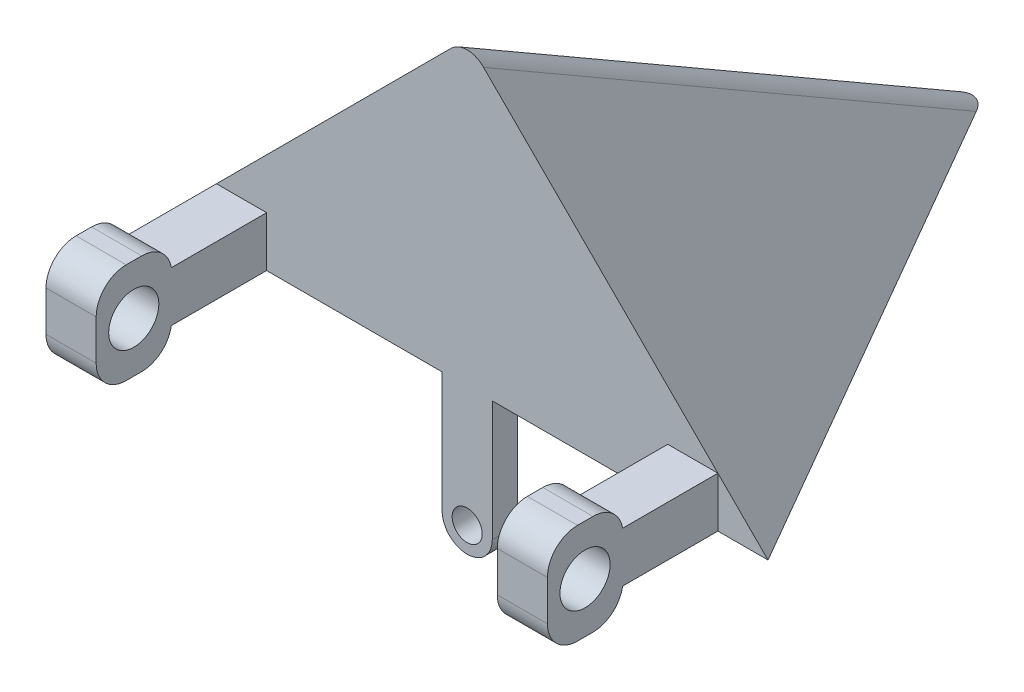
ISO-10303-21;
HEADER;
FILE_DESCRIPTION(('STEP AP214'),'2;1');
FILE_NAME('part.step','',(''),(''),'','','');
FILE_SCHEMA(('AUTOMOTIVE_DESIGN { 1 0 10303 214 1 1 1 1 }'));
ENDSEC;
DATA;
#1=APPLICATION_CONTEXT('core data for automotive mechanical design processes');
#2=APPLICATION_PROTOCOL_DEFINITION('international standard','automotive_design',2000,#1);
#3=PRODUCT_CONTEXT('',#1,'mechanical');
#4=PRODUCT('Part','Part','',(#3));
#5=PRODUCT_RELATED_PRODUCT_CATEGORY('part','',(#4));
#6=PRODUCT_DEFINITION_FORMATION('','',#4);
#7=PRODUCT_DEFINITION_CONTEXT('part definition',#1,'design');
#8=PRODUCT_DEFINITION('design','',#6,#7);
#9=PRODUCT_DEFINITION_SHAPE('','',#8);
#10=(LENGTH_UNIT() NAMED_UNIT(*) SI_UNIT(.MILLI.,.METRE.));
#11=(NAMED_UNIT(*) PLANE_ANGLE_UNIT() SI_UNIT($,.RADIAN.));
#12=(NAMED_UNIT(*) SI_UNIT($,.STERADIAN.) SOLID_ANGLE_UNIT());
#13=UNCERTAINTY_MEASURE_WITH_UNIT(LENGTH_MEASURE(1.E-05),#10,'distance_accuracy_value','');
#14=(GEOMETRIC_REPRESENTATION_CONTEXT(3) GLOBAL_UNCERTAINTY_ASSIGNED_CONTEXT((#13)) GLOBAL_UNIT_ASSIGNED_CONTEXT((#10,
#11,#12)) REPRESENTATION_CONTEXT('',''));
#15=CARTESIAN_POINT('',(0.,0.,0.));
#16=DIRECTION('',(0.,0.,1.));
#17=DIRECTION('',(1.,0.,0.));
#18=AXIS2_PLACEMENT_3D('',#15,#16,#17);
#19=CARTESIAN_POINT('',(0.,0.,0.));
#20=DIRECTION('',(0.,0.,-1.));
#21=DIRECTION('',(-1.,0.,0.));
#22=AXIS2_PLACEMENT_3D('',#19,#20,#21);
#23=PLANE('',#22);
#24=CARTESIAN_POINT('',(-30.,-12.,0.));
#25=DIRECTION('',(0.,0.,1.));
#26=DIRECTION('',(1.,0.,0.));
#27=AXIS2_PLACEMENT_3D('',#24,#25,#26);
#28=CIRCLE('',#27,1.5);
#29=CARTESIAN_POINT('',(-28.5,-12.,0.));
#30=VERTEX_POINT('',#29);
#31=EDGE_CURVE('E416',#30,#30,#28,.T.);
#32=ORIENTED_EDGE('',*,*,#31,.F.);
#33=EDGE_LOOP('',(#32));
#34=FACE_BOUND('',#33,.T.);
#35=DIRECTION('',(0.,1.,0.));
#36=VECTOR('',#35,1.);
#37=CARTESIAN_POINT('',(-32.5,-14.5,0.));
#38=LINE('',#37,#36);
#39=CARTESIAN_POINT('',(-32.5,-12.,0.));
#40=VERTEX_POINT('',#39);
#41=CARTESIAN_POINT('',(-32.5,0.,0.));
#42=VERTEX_POINT('',#41);
#43=EDGE_CURVE('E589',#40,#42,#38,.T.);
#44=ORIENTED_EDGE('',*,*,#43,.F.);
#45=CARTESIAN_POINT('',(-30.,-12.,0.));
#46=DIRECTION('',(0.,0.,-1.));
#47=DIRECTION('',(-1.,0.,0.));
#48=AXIS2_PLACEMENT_3D('',#45,#46,#47);
#49=CIRCLE('',#48,2.5);
#50=CARTESIAN_POINT('',(-30.,-14.5,0.));
#51=VERTEX_POINT('',#50);
#52=EDGE_CURVE('E431',#40,#51,#49,.F.);
#53=ORIENTED_EDGE('',*,*,#52,.T.);
#54=CARTESIAN_POINT('',(-30.,-12.,0.));
#55=DIRECTION('',(0.,0.,-1.));
#56=DIRECTION('',(-1.,0.,0.));
#57=AXIS2_PLACEMENT_3D('',#54,#55,#56);
#58=CIRCLE('',#57,2.5);
#59=CARTESIAN_POINT('',(-27.5,-12.,0.));
#60=VERTEX_POINT('',#59);
#61=EDGE_CURVE('E428',#51,#60,#58,.F.);
#62=ORIENTED_EDGE('',*,*,#61,.T.);
#63=DIRECTION('',(0.,1.,0.));
#64=VECTOR('',#63,1.);
#65=CARTESIAN_POINT('',(-27.5,-14.5,0.));
#66=LINE('',#65,#64);
#67=CARTESIAN_POINT('',(-27.5,0.,0.));
#68=VERTEX_POINT('',#67);
#69=EDGE_CURVE('E592',#60,#68,#66,.T.);
#70=ORIENTED_EDGE('',*,*,#69,.T.);
#71=DIRECTION('',(1.,0.,0.));
#72=VECTOR('',#71,1.);
#73=CARTESIAN_POINT('',(0.,0.,0.));
#74=LINE('',#73,#72);
#75=CARTESIAN_POINT('',(-10.,0.,0.));
#76=VERTEX_POINT('',#75);
#77=EDGE_CURVE('E300',#68,#76,#74,.T.);
#78=ORIENTED_EDGE('',*,*,#77,.T.);
#79=DIRECTION('',(0.,-1.,0.));
#80=VECTOR('',#79,1.);
#81=CARTESIAN_POINT('',(-9.99999999999999,0.,0.));
#82=LINE('',#81,#80);
#83=CARTESIAN_POINT('',(-10.,5.,0.));
#84=VERTEX_POINT('',#83);
#85=EDGE_CURVE('E399',#84,#76,#82,.T.);
#86=ORIENTED_EDGE('',*,*,#85,.F.);
#87=DIRECTION('',(-1.,0.,0.));
#88=VECTOR('',#87,1.);
#89=CARTESIAN_POINT('',(-10.,5.,0.));
#90=LINE('',#89,#88);
#91=CARTESIAN_POINT('',(-5.00000000000006,5.,0.));
#92=VERTEX_POINT('',#91);
#93=EDGE_CURVE('E398',#92,#84,#90,.T.);
#94=ORIENTED_EDGE('',*,*,#93,.F.);
#95=DIRECTION('',(-0.707106781186551,0.707106781186544,0.));
#96=VECTOR('',#95,1.);
#97=CARTESIAN_POINT('',(-30.0000000000002,29.9999999999999,0.));
#98=LINE('',#97,#96);
#99=CARTESIAN_POINT('',(-28.3633658232303,28.36336582323,0.));
#100=VERTEX_POINT('',#99);
#101=EDGE_CURVE('E345',#92,#100,#98,.T.);
#102=ORIENTED_EDGE('',*,*,#101,.T.);
#103=CARTESIAN_POINT('',(-30.0000000000002,26.18118692087,0.));
#104=DIRECTION('',(0.,0.,-1.));
#105=DIRECTION('',(0.,-1.,0.));
#106=AXIS2_PLACEMENT_3D('',#103,#104,#105);
#107=ELLIPSE('',#106,2.88675134594813,2.5);
#108=CARTESIAN_POINT('',(-31.6366341767702,28.36336582323,0.));
#109=VERTEX_POINT('',#108);
#110=EDGE_CURVE('E421',#100,#109,#107,.F.);
#111=ORIENTED_EDGE('',*,*,#110,.T.);
#112=DIRECTION('',(-0.707106781186546,-0.707106781186549,0.));
#113=VECTOR('',#112,1.);
#114=CARTESIAN_POINT('',(-30.0000000000002,29.9999999999999,0.));
#115=LINE('',#114,#113);
#116=CARTESIAN_POINT('',(-55.,5.,0.));
#117=VERTEX_POINT('',#116);
#118=EDGE_CURVE('E289',#109,#117,#115,.T.);
#119=ORIENTED_EDGE('',*,*,#118,.T.);
#120=DIRECTION('',(-1.,0.,0.));
#121=VECTOR('',#120,1.);
#122=CARTESIAN_POINT('',(-55.,5.,0.));
#123=LINE('',#122,#121);
#124=CARTESIAN_POINT('',(-50.,5.,0.));
#125=VERTEX_POINT('',#124);
#126=EDGE_CURVE('E266',#125,#117,#123,.T.);
#127=ORIENTED_EDGE('',*,*,#126,.F.);
#128=DIRECTION('',(0.,1.,0.));
#129=VECTOR('',#128,1.);
#130=CARTESIAN_POINT('',(-50.,0.,0.));
#131=LINE('',#130,#129);
#132=CARTESIAN_POINT('',(-50.,0.,0.));
#133=VERTEX_POINT('',#132);
#134=EDGE_CURVE('E274',#133,#125,#131,.T.);
#135=ORIENTED_EDGE('',*,*,#134,.F.);
#136=EDGE_CURVE('E315',#133,#42,#74,.T.);
#137=ORIENTED_EDGE('',*,*,#136,.T.);
#138=EDGE_LOOP('',(#44,#53,#62,#70,#78,#86,#94,#102,#111,#119,#127,#135,#137));
#139=FACE_BOUND('',#138,.T.);
#140=ADVANCED_FACE('F47',(#34,#139),#23,.F.);
#141=DIRECTION('',(0.,1.,0.));
#142=VECTOR('',#141,1.);
#143=CARTESIAN_POINT('',(-5.,0.,0.));
#144=LINE('',#143,#142);
#145=CARTESIAN_POINT('',(-5.,0.,0.));
#146=VERTEX_POINT('',#145);
#147=EDGE_CURVE('E394',#146,#92,#144,.T.);
#148=ORIENTED_EDGE('',*,*,#147,.F.);
#149=CARTESIAN_POINT('',(0.,0.,0.));
#150=VERTEX_POINT('',#149);
#151=EDGE_CURVE('E296',#146,#150,#74,.T.);
#152=ORIENTED_EDGE('',*,*,#151,.T.);
#153=EDGE_CURVE('E301',#150,#92,#98,.T.);
#154=ORIENTED_EDGE('',*,*,#153,.T.);
#155=EDGE_LOOP('',(#148,#152,#154));
#156=FACE_BOUND('',#155,.T.);
#157=ADVANCED_FACE('F751',(#156),#23,.F.);
#158=DIRECTION('',(0.,-1.,0.));
#159=VECTOR('',#158,1.);
#160=CARTESIAN_POINT('',(-55.,0.,0.));
#161=LINE('',#160,#159);
#162=CARTESIAN_POINT('',(-55.,0.,0.));
#163=VERTEX_POINT('',#162);
#164=EDGE_CURVE('E252',#117,#163,#161,.T.);
#165=ORIENTED_EDGE('',*,*,#164,.F.);
#166=CARTESIAN_POINT('',(-60.,0.,0.));
#167=VERTEX_POINT('',#166);
#168=EDGE_CURVE('E326',#117,#167,#115,.T.);
#169=ORIENTED_EDGE('',*,*,#168,.T.);
#170=EDGE_CURVE('E306',#167,#163,#74,.T.);
#171=ORIENTED_EDGE('',*,*,#170,.T.);
#172=EDGE_LOOP('',(#165,#169,#171));
#173=FACE_BOUND('',#172,.T.);
#174=ADVANCED_FACE('F334',(#173),#23,.F.);
#175=CARTESIAN_POINT('',(0.,0.,0.));
#176=DIRECTION('',(0.,-1.,0.));
#177=DIRECTION('',(0.,0.,-1.));
#178=AXIS2_PLACEMENT_3D('',#175,#176,#177);
#179=PLANE('',#178);
#180=DIRECTION('',(0.,0.,-1.));
#181=VECTOR('',#180,1.);
#182=CARTESIAN_POINT('',(-32.5,0.,0.));
#183=LINE('',#182,#181);
#184=CARTESIAN_POINT('',(-32.5,0.,-2.5));
#185=VERTEX_POINT('',#184);
#186=EDGE_CURVE('E415',#42,#185,#183,.T.);
#187=ORIENTED_EDGE('',*,*,#186,.F.);
#188=ORIENTED_EDGE('',*,*,#136,.F.);
#189=DIRECTION('',(0.,0.,-1.));
#190=VECTOR('',#189,1.);
#191=CARTESIAN_POINT('',(-50.,0.,9.5));
#192=LINE('',#191,#190);
#193=CARTESIAN_POINT('',(-50.,0.,9.5));
#194=VERTEX_POINT('',#193);
#195=EDGE_CURVE('E257',#194,#133,#192,.T.);
#196=ORIENTED_EDGE('',*,*,#195,.F.);
#197=DIRECTION('',(1.,0.,0.));
#198=VECTOR('',#197,1.);
#199=CARTESIAN_POINT('',(-55.,0.,9.5));
#200=LINE('',#199,#198);
#201=CARTESIAN_POINT('',(-55.,0.,9.5));
#202=VERTEX_POINT('',#201);
#203=EDGE_CURVE('E239',#202,#194,#200,.T.);
#204=ORIENTED_EDGE('',*,*,#203,.F.);
#205=DIRECTION('',(0.,0.,-1.));
#206=VECTOR('',#205,1.);
#207=CARTESIAN_POINT('',(-55.,0.,9.5));
#208=LINE('',#207,#206);
#209=EDGE_CURVE('E249',#202,#163,#208,.T.);
#210=ORIENTED_EDGE('',*,*,#209,.T.);
#211=ORIENTED_EDGE('',*,*,#170,.F.);
#212=DIRECTION('',(-0.500000000000004,0.,0.866025403784436));
#213=VECTOR('',#212,1.);
#214=CARTESIAN_POINT('',(-60.,0.,0.));
#215=LINE('',#214,#213);
#216=CARTESIAN_POINT('',(-31.6366341767697,0.,-49.126790679497));
#217=VERTEX_POINT('',#216);
#218=EDGE_CURVE('E336',#217,#167,#215,.T.);
#219=ORIENTED_EDGE('',*,*,#218,.F.);
#220=CARTESIAN_POINT('',(-29.9999999999998,0.,-45.3471459494047));
#221=DIRECTION('',(0.,-1.,0.));
#222=DIRECTION('',(0.,0.,-1.));
#223=AXIS2_PLACEMENT_3D('',#220,#221,#222);
#224=ELLIPSE('',#223,5.,2.5);
#225=CARTESIAN_POINT('',(-28.3633658232298,0.,-49.126790679497));
#226=VERTEX_POINT('',#225);
#227=EDGE_CURVE('E339',#217,#226,#224,.T.);
#228=ORIENTED_EDGE('',*,*,#227,.T.);
#229=DIRECTION('',(-0.499999999999998,0.,-0.86602540378444));
#230=VECTOR('',#229,1.);
#231=CARTESIAN_POINT('',(-29.9999999999998,0.,-51.9615242270662));
#232=LINE('',#231,#230);
#233=EDGE_CURVE('E256',#150,#226,#232,.T.);
#234=ORIENTED_EDGE('',*,*,#233,.F.);
#235=ORIENTED_EDGE('',*,*,#151,.F.);
#236=DIRECTION('',(0.,0.,-1.));
#237=VECTOR('',#236,1.);
#238=CARTESIAN_POINT('',(-5.,0.,9.5));
#239=LINE('',#238,#237);
#240=CARTESIAN_POINT('',(-5.,0.,9.5));
#241=VERTEX_POINT('',#240);
#242=EDGE_CURVE('E406',#241,#146,#239,.T.);
#243=ORIENTED_EDGE('',*,*,#242,.F.);
#244=DIRECTION('',(1.,0.,0.));
#245=VECTOR('',#244,1.);
#246=CARTESIAN_POINT('',(-9.99999999999999,0.,9.5));
#247=LINE('',#246,#245);
#248=CARTESIAN_POINT('',(-9.99999999999999,0.,9.5));
#249=VERTEX_POINT('',#248);
#250=EDGE_CURVE('E601',#249,#241,#247,.T.);
#251=ORIENTED_EDGE('',*,*,#250,.F.);
#252=DIRECTION('',(0.,0.,-1.));
#253=VECTOR('',#252,1.);
#254=CARTESIAN_POINT('',(-9.99999999999999,0.,9.5));
#255=LINE('',#254,#253);
#256=EDGE_CURVE('E277',#249,#76,#255,.T.);
#257=ORIENTED_EDGE('',*,*,#256,.T.);
#258=ORIENTED_EDGE('',*,*,#77,.F.);
#259=DIRECTION('',(0.,0.,1.));
#260=VECTOR('',#259,1.);
#261=CARTESIAN_POINT('',(-27.5,0.,0.));
#262=LINE('',#261,#260);
#263=CARTESIAN_POINT('',(-27.5,0.,-2.5));
#264=VERTEX_POINT('',#263);
#265=EDGE_CURVE('E585',#264,#68,#262,.T.);
#266=ORIENTED_EDGE('',*,*,#265,.F.);
#267=DIRECTION('',(1.,0.,0.));
#268=VECTOR('',#267,1.);
#269=CARTESIAN_POINT('',(-32.5,0.,-2.5));
#270=LINE('',#269,#268);
#271=EDGE_CURVE('E581',#185,#264,#270,.T.);
#272=ORIENTED_EDGE('',*,*,#271,.F.);
#273=EDGE_LOOP('',(#187,#188,#196,#204,#210,#211,#219,#228,#234,#235,#243,#251,#257,#258,#266,#272));
#274=FACE_BOUND('',#273,.T.);
#275=ADVANCED_FACE('F261',(#274),#179,.T.);
#276=CARTESIAN_POINT('',(-29.9999999999998,0.,-51.9615242270661));
#277=DIRECTION('',(-0.654653670707977,0.654653670707975,-0.377964473009231));
#278=DIRECTION('',(-0.500000000000004,0.,0.866025403784436));
#279=AXIS2_PLACEMENT_3D('',#276,#277,#278);
#280=PLANE('',#279);
#281=ORIENTED_EDGE('',*,*,#118,.F.);
#282=DIRECTION('',(0.,-0.5,-0.866025403784439));
#283=VECTOR('',#282,1.);
#284=CARTESIAN_POINT('',(-31.6366341767697,-1.22747563257745,-51.2528408401739));
#285=LINE('',#284,#283);
#286=EDGE_CURVE('E333',#109,#217,#285,.T.);
#287=ORIENTED_EDGE('',*,*,#286,.T.);
#288=ORIENTED_EDGE('',*,*,#218,.T.);
#289=ORIENTED_EDGE('',*,*,#168,.F.);
#290=EDGE_LOOP('',(#281,#287,#288,#289));
#291=FACE_BOUND('',#290,.T.);
#292=ADVANCED_FACE('F368',(#291),#280,.T.);
#293=CARTESIAN_POINT('',(0.,0.,0.));
#294=DIRECTION('',(0.654653670707975,0.654653670707982,-0.377964473009224));
#295=DIRECTION('',(-0.499999999999998,0.,-0.86602540378444));
#296=AXIS2_PLACEMENT_3D('',#293,#294,#295);
#297=PLANE('',#296);
#298=ORIENTED_EDGE('',*,*,#233,.T.);
#299=DIRECTION('',(0.,-0.5,-0.866025403784439));
#300=VECTOR('',#299,1.);
#301=CARTESIAN_POINT('',(-28.3633658232302,21.2725243674224,-12.2816976698744));
#302=LINE('',#301,#300);
#303=EDGE_CURVE('E681',#226,#100,#302,.F.);
#304=ORIENTED_EDGE('',*,*,#303,.T.);
#305=ORIENTED_EDGE('',*,*,#101,.F.);
#306=ORIENTED_EDGE('',*,*,#153,.F.);
#307=EDGE_LOOP('',(#298,#304,#305,#306));
#308=FACE_BOUND('',#307,.T.);
#309=ADVANCED_FACE('F643',(#308),#297,.T.);
#310=CARTESIAN_POINT('',(-29.9999999999998,-2.86410980934739,-50.3079296576508));
#311=DIRECTION('',(0.,-0.5,-0.866025403784439));
#312=DIRECTION('',(0.,0.866025403784439,-0.5));
#313=AXIS2_PLACEMENT_3D('',#310,#311,#312);
#314=CYLINDRICAL_SURFACE('',#313,2.5);
#315=ORIENTED_EDGE('',*,*,#110,.F.);
#316=ORIENTED_EDGE('',*,*,#303,.F.);
#317=ORIENTED_EDGE('',*,*,#227,.F.);
#318=ORIENTED_EDGE('',*,*,#286,.F.);
#319=EDGE_LOOP('',(#315,#316,#317,#318));
#320=FACE_BOUND('',#319,.T.);
#321=ADVANCED_FACE('F651',(#320),#314,.T.);
#322=CARTESIAN_POINT('',(-55.,0.,9.5));
#323=DIRECTION('',(1.,0.,0.));
#324=DIRECTION('',(0.,1.,0.));
#325=AXIS2_PLACEMENT_3D('',#322,#323,#324);
#326=PLANE('',#325);
#327=CARTESIAN_POINT('',(-55.,2.5,13.25));
#328=DIRECTION('',(1.,0.,0.));
#329=DIRECTION('',(0.,1.,0.));
#330=AXIS2_PLACEMENT_3D('',#327,#328,#329);
#331=CIRCLE('',#330,2.5);
#332=CARTESIAN_POINT('',(-55.,5.,13.25));
#333=VERTEX_POINT('',#332);
#334=EDGE_CURVE('E542',#333,#333,#331,.T.);
#335=ORIENTED_EDGE('',*,*,#334,.T.);
#336=EDGE_LOOP('',(#335));
#337=FACE_BOUND('',#336,.T.);
#338=ORIENTED_EDGE('',*,*,#209,.F.);
#339=CARTESIAN_POINT('',(-55.,0.49999999999999,12.4580398915498));
#340=DIRECTION('',(1.,0.,0.));
#341=DIRECTION('',(0.,1.,0.));
#342=AXIS2_PLACEMENT_3D('',#339,#340,#341);
#343=CIRCLE('',#342,3.);
#344=CARTESIAN_POINT('',(-55.,-2.5,12.4580398915498));
#345=VERTEX_POINT('',#344);
#346=EDGE_CURVE('E234',#202,#345,#343,.F.);
#347=ORIENTED_EDGE('',*,*,#346,.T.);
#348=DIRECTION('',(0.,0.,-1.));
#349=VECTOR('',#348,1.);
#350=CARTESIAN_POINT('',(-55.,-2.5,17.));
#351=LINE('',#350,#349);
#352=CARTESIAN_POINT('',(-55.,-2.5,14.));
#353=VERTEX_POINT('',#352);
#354=EDGE_CURVE('E536',#353,#345,#351,.T.);
#355=ORIENTED_EDGE('',*,*,#354,.F.);
#356=CARTESIAN_POINT('',(-55.,0.5,14.));
#357=DIRECTION('',(1.,0.,0.));
#358=DIRECTION('',(0.,1.,0.));
#359=AXIS2_PLACEMENT_3D('',#356,#357,#358);
#360=CIRCLE('',#359,3.);
#361=CARTESIAN_POINT('',(-55.,0.5,17.));
#362=VERTEX_POINT('',#361);
#363=EDGE_CURVE('E449',#353,#362,#360,.F.);
#364=ORIENTED_EDGE('',*,*,#363,.T.);
#365=DIRECTION('',(0.,-1.,0.));
#366=VECTOR('',#365,1.);
#367=CARTESIAN_POINT('',(-55.,7.5,17.));
#368=LINE('',#367,#366);
#369=CARTESIAN_POINT('',(-55.,4.5,17.));
#370=VERTEX_POINT('',#369);
#371=EDGE_CURVE('E546',#370,#362,#368,.T.);
#372=ORIENTED_EDGE('',*,*,#371,.F.);
#373=CARTESIAN_POINT('',(-55.,4.5,14.));
#374=DIRECTION('',(1.,0.,0.));
#375=DIRECTION('',(0.,1.,0.));
#376=AXIS2_PLACEMENT_3D('',#373,#374,#375);
#377=CIRCLE('',#376,3.);
#378=CARTESIAN_POINT('',(-55.,7.5,14.));
#379=VERTEX_POINT('',#378);
#380=EDGE_CURVE('E446',#370,#379,#377,.F.);
#381=ORIENTED_EDGE('',*,*,#380,.T.);
#382=DIRECTION('',(0.,0.,-1.));
#383=VECTOR('',#382,1.);
#384=CARTESIAN_POINT('',(-55.,7.5,17.));
#385=LINE('',#384,#383);
#386=CARTESIAN_POINT('',(-55.,7.5,12.4580398915498));
#387=VERTEX_POINT('',#386);
#388=EDGE_CURVE('E527',#379,#387,#385,.T.);
#389=ORIENTED_EDGE('',*,*,#388,.T.);
#390=CARTESIAN_POINT('',(-55.,4.5,12.4580398915498));
#391=DIRECTION('',(1.,0.,0.));
#392=DIRECTION('',(0.,1.,0.));
#393=AXIS2_PLACEMENT_3D('',#390,#391,#392);
#394=CIRCLE('',#393,3.);
#395=CARTESIAN_POINT('',(-55.,5.,9.5));
#396=VERTEX_POINT('',#395);
#397=EDGE_CURVE('E245',#387,#396,#394,.F.);
#398=ORIENTED_EDGE('',*,*,#397,.T.);
#399=DIRECTION('',(0.,0.,-1.));
#400=VECTOR('',#399,1.);
#401=CARTESIAN_POINT('',(-55.,5.,9.5));
#402=LINE('',#401,#400);
#403=EDGE_CURVE('E271',#396,#117,#402,.T.);
#404=ORIENTED_EDGE('',*,*,#403,.T.);
#405=ORIENTED_EDGE('',*,*,#164,.T.);
#406=EDGE_LOOP('',(#338,#347,#355,#364,#372,#381,#389,#398,#404,#405));
#407=FACE_BOUND('',#406,.T.);
#408=ADVANCED_FACE('F250',(#337,#407),#326,.F.);
#409=CARTESIAN_POINT('',(-50.,0.,9.5));
#410=DIRECTION('',(-1.,0.,0.));
#411=DIRECTION('',(0.,0.,1.));
#412=AXIS2_PLACEMENT_3D('',#409,#410,#411);
#413=PLANE('',#412);
#414=CARTESIAN_POINT('',(-50.,2.5,13.25));
#415=DIRECTION('',(-1.,0.,0.));
#416=DIRECTION('',(0.,0.,1.));
#417=AXIS2_PLACEMENT_3D('',#414,#415,#416);
#418=CIRCLE('',#417,2.5);
#419=CARTESIAN_POINT('',(-50.,2.5,15.75));
#420=VERTEX_POINT('',#419);
#421=EDGE_CURVE('E722',#420,#420,#418,.T.);
#422=ORIENTED_EDGE('',*,*,#421,.T.);
#423=EDGE_LOOP('',(#422));
#424=FACE_BOUND('',#423,.T.);
#425=DIRECTION('',(0.,0.,-1.));
#426=VECTOR('',#425,1.);
#427=CARTESIAN_POINT('',(-50.,-2.5,17.));
#428=LINE('',#427,#426);
#429=CARTESIAN_POINT('',(-50.,-2.5,14.));
#430=VERTEX_POINT('',#429);
#431=CARTESIAN_POINT('',(-50.,-2.5,12.4580398915498));
#432=VERTEX_POINT('',#431);
#433=EDGE_CURVE('E540',#430,#432,#428,.T.);
#434=ORIENTED_EDGE('',*,*,#433,.T.);
#435=CARTESIAN_POINT('',(-50.,0.49999999999999,12.4580398915498));
#436=DIRECTION('',(-1.,0.,0.));
#437=DIRECTION('',(0.,0.,1.));
#438=AXIS2_PLACEMENT_3D('',#435,#436,#437);
#439=CIRCLE('',#438,3.);
#440=EDGE_CURVE('E501',#432,#194,#439,.F.);
#441=ORIENTED_EDGE('',*,*,#440,.T.);
#442=ORIENTED_EDGE('',*,*,#195,.T.);
#443=ORIENTED_EDGE('',*,*,#134,.T.);
#444=DIRECTION('',(0.,0.,-1.));
#445=VECTOR('',#444,1.);
#446=CARTESIAN_POINT('',(-50.,5.,9.5));
#447=LINE('',#446,#445);
#448=CARTESIAN_POINT('',(-50.,5.,9.5));
#449=VERTEX_POINT('',#448);
#450=EDGE_CURVE('E285',#449,#125,#447,.T.);
#451=ORIENTED_EDGE('',*,*,#450,.F.);
#452=CARTESIAN_POINT('',(-50.,4.5,12.4580398915498));
#453=DIRECTION('',(-1.,0.,0.));
#454=DIRECTION('',(0.,0.,1.));
#455=AXIS2_PLACEMENT_3D('',#452,#453,#454);
#456=CIRCLE('',#455,3.);
#457=CARTESIAN_POINT('',(-50.,7.5,12.4580398915498));
#458=VERTEX_POINT('',#457);
#459=EDGE_CURVE('E498',#449,#458,#456,.F.);
#460=ORIENTED_EDGE('',*,*,#459,.T.);
#461=DIRECTION('',(0.,0.,-1.));
#462=VECTOR('',#461,1.);
#463=CARTESIAN_POINT('',(-50.,7.5,17.));
#464=LINE('',#463,#462);
#465=CARTESIAN_POINT('',(-50.,7.5,14.));
#466=VERTEX_POINT('',#465);
#467=EDGE_CURVE('E530',#466,#458,#464,.T.);
#468=ORIENTED_EDGE('',*,*,#467,.F.);
#469=CARTESIAN_POINT('',(-50.,4.5,14.));
#470=DIRECTION('',(-1.,0.,0.));
#471=DIRECTION('',(0.,0.,1.));
#472=AXIS2_PLACEMENT_3D('',#469,#470,#471);
#473=CIRCLE('',#472,3.);
#474=CARTESIAN_POINT('',(-50.,4.5,17.));
#475=VERTEX_POINT('',#474);
#476=EDGE_CURVE('E459',#466,#475,#473,.F.);
#477=ORIENTED_EDGE('',*,*,#476,.T.);
#478=DIRECTION('',(0.,-1.,0.));
#479=VECTOR('',#478,1.);
#480=CARTESIAN_POINT('',(-50.,7.5,17.));
#481=LINE('',#480,#479);
#482=CARTESIAN_POINT('',(-50.,0.499999999999999,17.));
#483=VERTEX_POINT('',#482);
#484=EDGE_CURVE('E550',#475,#483,#481,.T.);
#485=ORIENTED_EDGE('',*,*,#484,.T.);
#486=CARTESIAN_POINT('',(-50.,0.499999999999999,14.));
#487=DIRECTION('',(-1.,0.,0.));
#488=DIRECTION('',(0.,0.,1.));
#489=AXIS2_PLACEMENT_3D('',#486,#487,#488);
#490=CIRCLE('',#489,3.);
#491=EDGE_CURVE('E462',#483,#430,#490,.F.);
#492=ORIENTED_EDGE('',*,*,#491,.T.);
#493=EDGE_LOOP('',(#434,#441,#442,#443,#451,#460,#468,#477,#485,#492));
#494=FACE_BOUND('',#493,.T.);
#495=ADVANCED_FACE('F712',(#424,#494),#413,.F.);
#496=CARTESIAN_POINT('',(-55.,5.,9.5));
#497=DIRECTION('',(0.,-1.,0.));
#498=DIRECTION('',(0.,0.,-1.));
#499=AXIS2_PLACEMENT_3D('',#496,#497,#498);
#500=PLANE('',#499);
#501=ORIENTED_EDGE('',*,*,#126,.T.);
#502=ORIENTED_EDGE('',*,*,#403,.F.);
#503=DIRECTION('',(-1.,0.,0.));
#504=VECTOR('',#503,1.);
#505=CARTESIAN_POINT('',(-55.,5.,9.5));
#506=LINE('',#505,#504);
#507=EDGE_CURVE('E265',#449,#396,#506,.T.);
#508=ORIENTED_EDGE('',*,*,#507,.F.);
#509=ORIENTED_EDGE('',*,*,#450,.T.);
#510=EDGE_LOOP('',(#501,#502,#508,#509));
#511=FACE_BOUND('',#510,.T.);
#512=ADVANCED_FACE('F699',(#511),#500,.F.);
#513=CARTESIAN_POINT('',(-9.99999999999999,0.,9.5));
#514=DIRECTION('',(1.,0.,0.));
#515=DIRECTION('',(0.,1.,0.));
#516=AXIS2_PLACEMENT_3D('',#513,#514,#515);
#517=PLANE('',#516);
#518=CARTESIAN_POINT('',(-9.99999999999999,2.5,13.25));
#519=DIRECTION('',(1.,0.,0.));
#520=DIRECTION('',(0.,1.,0.));
#521=AXIS2_PLACEMENT_3D('',#518,#519,#520);
#522=CIRCLE('',#521,2.5);
#523=CARTESIAN_POINT('',(-10.,5.,13.25));
#524=VERTEX_POINT('',#523);
#525=EDGE_CURVE('E726',#524,#524,#522,.T.);
#526=ORIENTED_EDGE('',*,*,#525,.T.);
#527=EDGE_LOOP('',(#526));
#528=FACE_BOUND('',#527,.T.);
#529=ORIENTED_EDGE('',*,*,#256,.F.);
#530=CARTESIAN_POINT('',(-9.99999999999999,0.5,12.4580398915498));
#531=DIRECTION('',(1.,0.,0.));
#532=DIRECTION('',(0.,1.,0.));
#533=AXIS2_PLACEMENT_3D('',#530,#531,#532);
#534=CIRCLE('',#533,3.);
#535=CARTESIAN_POINT('',(-9.99999999999999,-2.5,12.4580398915498));
#536=VERTEX_POINT('',#535);
#537=EDGE_CURVE('E516',#249,#536,#534,.F.);
#538=ORIENTED_EDGE('',*,*,#537,.T.);
#539=DIRECTION('',(0.,0.,-1.));
#540=VECTOR('',#539,1.);
#541=CARTESIAN_POINT('',(-10.,-2.5,17.));
#542=LINE('',#541,#540);
#543=CARTESIAN_POINT('',(-10.,-2.5,14.));
#544=VERTEX_POINT('',#543);
#545=EDGE_CURVE('E442',#544,#536,#542,.T.);
#546=ORIENTED_EDGE('',*,*,#545,.F.);
#547=CARTESIAN_POINT('',(-9.99999999999999,0.499999999999999,14.));
#548=DIRECTION('',(1.,0.,0.));
#549=DIRECTION('',(0.,1.,0.));
#550=AXIS2_PLACEMENT_3D('',#547,#548,#549);
#551=CIRCLE('',#550,3.);
#552=CARTESIAN_POINT('',(-10.,0.499999999999999,17.));
#553=VERTEX_POINT('',#552);
#554=EDGE_CURVE('E487',#544,#553,#551,.F.);
#555=ORIENTED_EDGE('',*,*,#554,.T.);
#556=DIRECTION('',(0.,-1.,0.));
#557=VECTOR('',#556,1.);
#558=CARTESIAN_POINT('',(-10.,7.5,17.));
#559=LINE('',#558,#557);
#560=CARTESIAN_POINT('',(-10.,4.5,17.));
#561=VERTEX_POINT('',#560);
#562=EDGE_CURVE('E554',#561,#553,#559,.T.);
#563=ORIENTED_EDGE('',*,*,#562,.F.);
#564=CARTESIAN_POINT('',(-10.,4.5,14.));
#565=DIRECTION('',(1.,0.,0.));
#566=DIRECTION('',(0.,1.,0.));
#567=AXIS2_PLACEMENT_3D('',#564,#565,#566);
#568=CIRCLE('',#567,3.);
#569=CARTESIAN_POINT('',(-10.,7.5,14.));
#570=VERTEX_POINT('',#569);
#571=EDGE_CURVE('E484',#561,#570,#568,.F.);
#572=ORIENTED_EDGE('',*,*,#571,.T.);
#573=DIRECTION('',(0.,0.,-1.));
#574=VECTOR('',#573,1.);
#575=CARTESIAN_POINT('',(-10.,7.5,17.));
#576=LINE('',#575,#574);
#577=CARTESIAN_POINT('',(-10.,7.5,12.4580398915498));
#578=VERTEX_POINT('',#577);
#579=EDGE_CURVE('E562',#570,#578,#576,.T.);
#580=ORIENTED_EDGE('',*,*,#579,.T.);
#581=CARTESIAN_POINT('',(-10.,4.5,12.4580398915498));
#582=DIRECTION('',(1.,0.,0.));
#583=DIRECTION('',(0.,1.,0.));
#584=AXIS2_PLACEMENT_3D('',#581,#582,#583);
#585=CIRCLE('',#584,3.);
#586=CARTESIAN_POINT('',(-10.,5.,9.5));
#587=VERTEX_POINT('',#586);
#588=EDGE_CURVE('E513',#578,#587,#585,.F.);
#589=ORIENTED_EDGE('',*,*,#588,.T.);
#590=DIRECTION('',(0.,0.,-1.));
#591=VECTOR('',#590,1.);
#592=CARTESIAN_POINT('',(-10.,5.,9.5));
#593=LINE('',#592,#591);
#594=EDGE_CURVE('E407',#587,#84,#593,.T.);
#595=ORIENTED_EDGE('',*,*,#594,.T.);
#596=ORIENTED_EDGE('',*,*,#85,.T.);
#597=EDGE_LOOP('',(#529,#538,#546,#555,#563,#572,#580,#589,#595,#596));
#598=FACE_BOUND('',#597,.T.);
#599=ADVANCED_FACE('F624',(#528,#598),#517,.F.);
#600=CARTESIAN_POINT('',(-5.,0.,9.5));
#601=DIRECTION('',(-1.,0.,0.));
#602=DIRECTION('',(0.,0.,1.));
#603=AXIS2_PLACEMENT_3D('',#600,#601,#602);
#604=PLANE('',#603);
#605=CARTESIAN_POINT('',(-5.,2.5,13.25));
#606=DIRECTION('',(-1.,0.,0.));
#607=DIRECTION('',(0.,0.,1.));
#608=AXIS2_PLACEMENT_3D('',#605,#606,#607);
#609=CIRCLE('',#608,2.5);
#610=CARTESIAN_POINT('',(-5.,2.5,15.75));
#611=VERTEX_POINT('',#610);
#612=EDGE_CURVE('E51',#611,#611,#609,.T.);
#613=ORIENTED_EDGE('',*,*,#612,.T.);
#614=EDGE_LOOP('',(#613));
#615=FACE_BOUND('',#614,.T.);
#616=DIRECTION('',(0.,0.,-1.));
#617=VECTOR('',#616,1.);
#618=CARTESIAN_POINT('',(-5.,-2.5,17.));
#619=LINE('',#618,#617);
#620=CARTESIAN_POINT('',(-5.,-2.5,14.));
#621=VERTEX_POINT('',#620);
#622=CARTESIAN_POINT('',(-5.,-2.5,12.4580398915498));
#623=VERTEX_POINT('',#622);
#624=EDGE_CURVE('E568',#621,#623,#619,.T.);
#625=ORIENTED_EDGE('',*,*,#624,.T.);
#626=CARTESIAN_POINT('',(-5.,0.5,12.4580398915498));
#627=DIRECTION('',(-1.,0.,0.));
#628=DIRECTION('',(0.,0.,1.));
#629=AXIS2_PLACEMENT_3D('',#626,#627,#628);
#630=CIRCLE('',#629,3.);
#631=EDGE_CURVE('E510',#623,#241,#630,.F.);
#632=ORIENTED_EDGE('',*,*,#631,.T.);
#633=ORIENTED_EDGE('',*,*,#242,.T.);
#634=ORIENTED_EDGE('',*,*,#147,.T.);
#635=DIRECTION('',(0.,0.,-1.));
#636=VECTOR('',#635,1.);
#637=CARTESIAN_POINT('',(-5.,5.,9.5));
#638=LINE('',#637,#636);
#639=CARTESIAN_POINT('',(-5.,5.,9.5));
#640=VERTEX_POINT('',#639);
#641=EDGE_CURVE('E402',#640,#92,#638,.T.);
#642=ORIENTED_EDGE('',*,*,#641,.F.);
#643=CARTESIAN_POINT('',(-5.,4.5,12.4580398915498));
#644=DIRECTION('',(-1.,0.,0.));
#645=DIRECTION('',(0.,0.,1.));
#646=AXIS2_PLACEMENT_3D('',#643,#644,#645);
#647=CIRCLE('',#646,3.);
#648=CARTESIAN_POINT('',(-5.,7.5,12.4580398915498));
#649=VERTEX_POINT('',#648);
#650=EDGE_CURVE('E70',#640,#649,#647,.F.);
#651=ORIENTED_EDGE('',*,*,#650,.T.);
#652=DIRECTION('',(0.,0.,-1.));
#653=VECTOR('',#652,1.);
#654=CARTESIAN_POINT('',(-5.,7.5,17.));
#655=LINE('',#654,#653);
#656=CARTESIAN_POINT('',(-5.,7.5,14.));
#657=VERTEX_POINT('',#656);
#658=EDGE_CURVE('E565',#657,#649,#655,.T.);
#659=ORIENTED_EDGE('',*,*,#658,.F.);
#660=CARTESIAN_POINT('',(-5.,4.5,14.));
#661=DIRECTION('',(-1.,0.,0.));
#662=DIRECTION('',(0.,0.,1.));
#663=AXIS2_PLACEMENT_3D('',#660,#661,#662);
#664=CIRCLE('',#663,3.);
#665=CARTESIAN_POINT('',(-5.,4.5,17.));
#666=VERTEX_POINT('',#665);
#667=EDGE_CURVE('E475',#657,#666,#664,.F.);
#668=ORIENTED_EDGE('',*,*,#667,.T.);
#669=DIRECTION('',(0.,-1.,0.));
#670=VECTOR('',#669,1.);
#671=CARTESIAN_POINT('',(-5.,7.5,17.));
#672=LINE('',#671,#670);
#673=CARTESIAN_POINT('',(-5.,0.5,17.));
#674=VERTEX_POINT('',#673);
#675=EDGE_CURVE('E558',#666,#674,#672,.T.);
#676=ORIENTED_EDGE('',*,*,#675,.T.);
#677=CARTESIAN_POINT('',(-5.,0.5,14.));
#678=DIRECTION('',(-1.,0.,0.));
#679=DIRECTION('',(0.,0.,1.));
#680=AXIS2_PLACEMENT_3D('',#677,#678,#679);
#681=CIRCLE('',#680,3.);
#682=EDGE_CURVE('E478',#674,#621,#681,.F.);
#683=ORIENTED_EDGE('',*,*,#682,.T.);
#684=EDGE_LOOP('',(#625,#632,#633,#634,#642,#651,#659,#668,#676,#683));
#685=FACE_BOUND('',#684,.T.);
#686=ADVANCED_FACE('F735',(#615,#685),#604,.F.);
#687=CARTESIAN_POINT('',(-10.,5.,9.5));
#688=DIRECTION('',(0.,-1.,0.));
#689=DIRECTION('',(0.,0.,-1.));
#690=AXIS2_PLACEMENT_3D('',#687,#688,#689);
#691=PLANE('',#690);
#692=ORIENTED_EDGE('',*,*,#93,.T.);
#693=ORIENTED_EDGE('',*,*,#594,.F.);
#694=DIRECTION('',(-1.,0.,0.));
#695=VECTOR('',#694,1.);
#696=CARTESIAN_POINT('',(-10.,5.,9.5));
#697=LINE('',#696,#695);
#698=EDGE_CURVE('E605',#640,#587,#697,.T.);
#699=ORIENTED_EDGE('',*,*,#698,.F.);
#700=ORIENTED_EDGE('',*,*,#641,.T.);
#701=EDGE_LOOP('',(#692,#693,#699,#700));
#702=FACE_BOUND('',#701,.T.);
#703=ADVANCED_FACE('F631',(#702),#691,.F.);
#704=CARTESIAN_POINT('',(-32.5,-14.5,0.));
#705=DIRECTION('',(1.,0.,0.));
#706=DIRECTION('',(0.,0.,-1.));
#707=AXIS2_PLACEMENT_3D('',#704,#705,#706);
#708=PLANE('',#707);
#709=DIRECTION('',(0.,1.,0.));
#710=VECTOR('',#709,1.);
#711=CARTESIAN_POINT('',(-32.5,-14.5,-2.5));
#712=LINE('',#711,#710);
#713=CARTESIAN_POINT('',(-32.5,-12.,-2.5));
#714=VERTEX_POINT('',#713);
#715=EDGE_CURVE('E598',#714,#185,#712,.T.);
#716=ORIENTED_EDGE('',*,*,#715,.F.);
#717=DIRECTION('',(0.,0.,-1.));
#718=VECTOR('',#717,1.);
#719=CARTESIAN_POINT('',(-32.5,-12.,0.));
#720=LINE('',#719,#718);
#721=EDGE_CURVE('E424',#714,#40,#720,.F.);
#722=ORIENTED_EDGE('',*,*,#721,.T.);
#723=ORIENTED_EDGE('',*,*,#43,.T.);
#724=ORIENTED_EDGE('',*,*,#186,.T.);
#725=EDGE_LOOP('',(#716,#722,#723,#724));
#726=FACE_BOUND('',#725,.T.);
#727=ADVANCED_FACE('F820',(#726),#708,.F.);
#728=CARTESIAN_POINT('',(-32.5,-14.5,-2.5));
#729=DIRECTION('',(0.,0.,1.));
#730=DIRECTION('',(1.,0.,0.));
#731=AXIS2_PLACEMENT_3D('',#728,#729,#730);
#732=PLANE('',#731);
#733=CARTESIAN_POINT('',(-30.,-12.,-2.5));
#734=DIRECTION('',(0.,0.,1.));
#735=DIRECTION('',(1.,0.,0.));
#736=AXIS2_PLACEMENT_3D('',#733,#734,#735);
#737=CIRCLE('',#736,1.5);
#738=CARTESIAN_POINT('',(-28.5,-12.,-2.5));
#739=VERTEX_POINT('',#738);
#740=EDGE_CURVE('E411',#739,#739,#737,.T.);
#741=ORIENTED_EDGE('',*,*,#740,.T.);
#742=EDGE_LOOP('',(#741));
#743=FACE_BOUND('',#742,.T.);
#744=CARTESIAN_POINT('',(-30.,-12.,-2.5));
#745=DIRECTION('',(0.,0.,1.));
#746=DIRECTION('',(1.,0.,0.));
#747=AXIS2_PLACEMENT_3D('',#744,#745,#746);
#748=CIRCLE('',#747,2.5);
#749=CARTESIAN_POINT('',(-27.5,-12.,-2.5));
#750=VERTEX_POINT('',#749);
#751=CARTESIAN_POINT('',(-30.,-14.5,-2.5));
#752=VERTEX_POINT('',#751);
#753=EDGE_CURVE('E417',#750,#752,#748,.F.);
#754=ORIENTED_EDGE('',*,*,#753,.T.);
#755=CARTESIAN_POINT('',(-30.,-12.,-2.5));
#756=DIRECTION('',(0.,0.,1.));
#757=DIRECTION('',(1.,0.,0.));
#758=AXIS2_PLACEMENT_3D('',#755,#756,#757);
#759=CIRCLE('',#758,2.5);
#760=EDGE_CURVE('E420',#752,#714,#759,.F.);
#761=ORIENTED_EDGE('',*,*,#760,.T.);
#762=ORIENTED_EDGE('',*,*,#715,.T.);
#763=ORIENTED_EDGE('',*,*,#271,.T.);
#764=DIRECTION('',(0.,1.,0.));
#765=VECTOR('',#764,1.);
#766=CARTESIAN_POINT('',(-27.5,-14.5,-2.5));
#767=LINE('',#766,#765);
#768=EDGE_CURVE('E595',#750,#264,#767,.T.);
#769=ORIENTED_EDGE('',*,*,#768,.F.);
#770=EDGE_LOOP('',(#754,#761,#762,#763,#769));
#771=FACE_BOUND('',#770,.T.);
#772=ADVANCED_FACE('F828',(#743,#771),#732,.F.);
#773=CARTESIAN_POINT('',(-27.5,-14.5,0.));
#774=DIRECTION('',(-1.,0.,0.));
#775=DIRECTION('',(0.,0.,1.));
#776=AXIS2_PLACEMENT_3D('',#773,#774,#775);
#777=PLANE('',#776);
#778=ORIENTED_EDGE('',*,*,#69,.F.);
#779=DIRECTION('',(0.,0.,1.));
#780=VECTOR('',#779,1.);
#781=CARTESIAN_POINT('',(-27.5,-12.,-2.5));
#782=LINE('',#781,#780);
#783=EDGE_CURVE('E434',#60,#750,#782,.F.);
#784=ORIENTED_EDGE('',*,*,#783,.T.);
#785=ORIENTED_EDGE('',*,*,#768,.T.);
#786=ORIENTED_EDGE('',*,*,#265,.T.);
#787=EDGE_LOOP('',(#778,#784,#785,#786));
#788=FACE_BOUND('',#787,.T.);
#789=ADVANCED_FACE('F836',(#788),#777,.F.);
#790=CARTESIAN_POINT('',(-30.,-12.,-10.));
#791=DIRECTION('',(0.,0.,1.));
#792=DIRECTION('',(1.,0.,0.));
#793=AXIS2_PLACEMENT_3D('',#790,#791,#792);
#794=CYLINDRICAL_SURFACE('',#793,1.5);
#795=ORIENTED_EDGE('',*,*,#31,.T.);
#796=EDGE_LOOP('',(#795));
#797=FACE_BOUND('',#796,.T.);
#798=ORIENTED_EDGE('',*,*,#740,.F.);
#799=EDGE_LOOP('',(#798));
#800=FACE_BOUND('',#799,.T.);
#801=ADVANCED_FACE('F844',(#797,#800),#794,.F.);
#802=CARTESIAN_POINT('',(-30.,-12.,0.));
#803=DIRECTION('',(0.,0.,-1.));
#804=DIRECTION('',(-1.,0.,0.));
#805=AXIS2_PLACEMENT_3D('',#802,#803,#804);
#806=CYLINDRICAL_SURFACE('',#805,2.5);
#807=ORIENTED_EDGE('',*,*,#783,.F.);
#808=ORIENTED_EDGE('',*,*,#61,.F.);
#809=DIRECTION('',(0.,0.,1.));
#810=VECTOR('',#809,1.);
#811=CARTESIAN_POINT('',(-30.,-14.5,0.));
#812=LINE('',#811,#810);
#813=EDGE_CURVE('E438',#752,#51,#812,.T.);
#814=ORIENTED_EDGE('',*,*,#813,.F.);
#815=ORIENTED_EDGE('',*,*,#753,.F.);
#816=EDGE_LOOP('',(#807,#808,#814,#815));
#817=FACE_BOUND('',#816,.T.);
#818=ADVANCED_FACE('F852',(#817),#806,.T.);
#819=CARTESIAN_POINT('',(-30.,-12.,0.));
#820=DIRECTION('',(0.,0.,1.));
#821=DIRECTION('',(1.,0.,0.));
#822=AXIS2_PLACEMENT_3D('',#819,#820,#821);
#823=CYLINDRICAL_SURFACE('',#822,2.5);
#824=ORIENTED_EDGE('',*,*,#52,.F.);
#825=ORIENTED_EDGE('',*,*,#721,.F.);
#826=ORIENTED_EDGE('',*,*,#760,.F.);
#827=ORIENTED_EDGE('',*,*,#813,.T.);
#828=EDGE_LOOP('',(#824,#825,#826,#827));
#829=FACE_BOUND('',#828,.T.);
#830=ADVANCED_FACE('F859',(#829),#823,.T.);
#831=CARTESIAN_POINT('',(-10.,-2.5,17.));
#832=DIRECTION('',(0.,1.,0.));
#833=DIRECTION('',(-1.,0.,0.));
#834=AXIS2_PLACEMENT_3D('',#831,#832,#833);
#835=PLANE('',#834);
#836=ORIENTED_EDGE('',*,*,#545,.T.);
#837=DIRECTION('',(1.,0.,0.));
#838=VECTOR('',#837,1.);
#839=CARTESIAN_POINT('',(-10.,-2.5,12.4580398915498));
#840=LINE('',#839,#838);
#841=EDGE_CURVE('E504',#536,#623,#840,.T.);
#842=ORIENTED_EDGE('',*,*,#841,.T.);
#843=ORIENTED_EDGE('',*,*,#624,.F.);
#844=DIRECTION('',(1.,0.,0.));
#845=VECTOR('',#844,1.);
#846=CARTESIAN_POINT('',(-10.,-2.5,14.));
#847=LINE('',#846,#845);
#848=EDGE_CURVE('E481',#621,#544,#847,.F.);
#849=ORIENTED_EDGE('',*,*,#848,.T.);
#850=EDGE_LOOP('',(#836,#842,#843,#849));
#851=FACE_BOUND('',#850,.T.);
#852=ADVANCED_FACE('F867',(#851),#835,.F.);
#853=CARTESIAN_POINT('',(-10.,7.5,17.));
#854=DIRECTION('',(0.,1.,0.));
#855=DIRECTION('',(0.,0.,1.));
#856=AXIS2_PLACEMENT_3D('',#853,#854,#855);
#857=PLANE('',#856);
#858=ORIENTED_EDGE('',*,*,#658,.T.);
#859=DIRECTION('',(-1.,0.,0.));
#860=VECTOR('',#859,1.);
#861=CARTESIAN_POINT('',(-10.,7.5,12.4580398915498));
#862=LINE('',#861,#860);
#863=EDGE_CURVE('E12',#649,#578,#862,.T.);
#864=ORIENTED_EDGE('',*,*,#863,.T.);
#865=ORIENTED_EDGE('',*,*,#579,.F.);
#866=DIRECTION('',(1.,0.,0.));
#867=VECTOR('',#866,1.);
#868=CARTESIAN_POINT('',(-10.,7.5,14.));
#869=LINE('',#868,#867);
#870=EDGE_CURVE('E490',#570,#657,#869,.T.);
#871=ORIENTED_EDGE('',*,*,#870,.T.);
#872=EDGE_LOOP('',(#858,#864,#865,#871));
#873=FACE_BOUND('',#872,.T.);
#874=ADVANCED_FACE('F875',(#873),#857,.T.);
#875=CARTESIAN_POINT('',(0.,0.,17.));
#876=DIRECTION('',(0.,0.,1.));
#877=DIRECTION('',(1.,0.,0.));
#878=AXIS2_PLACEMENT_3D('',#875,#876,#877);
#879=PLANE('',#878);
#880=ORIENTED_EDGE('',*,*,#562,.T.);
#881=DIRECTION('',(1.,0.,0.));
#882=VECTOR('',#881,1.);
#883=CARTESIAN_POINT('',(-5.,0.5,17.));
#884=LINE('',#883,#882);
#885=EDGE_CURVE('E471',#553,#674,#884,.T.);
#886=ORIENTED_EDGE('',*,*,#885,.T.);
#887=ORIENTED_EDGE('',*,*,#675,.F.);
#888=DIRECTION('',(1.,0.,0.));
#889=VECTOR('',#888,1.);
#890=CARTESIAN_POINT('',(0.,4.5,17.));
#891=LINE('',#890,#889);
#892=EDGE_CURVE('E468',#666,#561,#891,.F.);
#893=ORIENTED_EDGE('',*,*,#892,.T.);
#894=EDGE_LOOP('',(#880,#886,#887,#893));
#895=FACE_BOUND('',#894,.T.);
#896=ADVANCED_FACE('F883',(#895),#879,.T.);
#897=CARTESIAN_POINT('',(-50.,7.5,17.));
#898=DIRECTION('',(0.,-1.,0.));
#899=DIRECTION('',(0.,0.,-1.));
#900=AXIS2_PLACEMENT_3D('',#897,#898,#899);
#901=PLANE('',#900);
#902=ORIENTED_EDGE('',*,*,#467,.T.);
#903=DIRECTION('',(-1.,0.,0.));
#904=VECTOR('',#903,1.);
#905=CARTESIAN_POINT('',(-50.,7.5,12.4580398915498));
#906=LINE('',#905,#904);
#907=EDGE_CURVE('E57',#458,#387,#906,.T.);
#908=ORIENTED_EDGE('',*,*,#907,.T.);
#909=ORIENTED_EDGE('',*,*,#388,.F.);
#910=DIRECTION('',(-1.,0.,0.));
#911=VECTOR('',#910,1.);
#912=CARTESIAN_POINT('',(-50.,7.5,14.));
#913=LINE('',#912,#911);
#914=EDGE_CURVE('E465',#379,#466,#913,.F.);
#915=ORIENTED_EDGE('',*,*,#914,.T.);
#916=EDGE_LOOP('',(#902,#908,#909,#915));
#917=FACE_BOUND('',#916,.T.);
#918=ADVANCED_FACE('F526',(#917),#901,.F.);
#919=CARTESIAN_POINT('',(-50.,-2.5,17.));
#920=DIRECTION('',(0.,-1.,0.));
#921=DIRECTION('',(1.,0.,0.));
#922=AXIS2_PLACEMENT_3D('',#919,#920,#921);
#923=PLANE('',#922);
#924=ORIENTED_EDGE('',*,*,#354,.T.);
#925=DIRECTION('',(1.,0.,0.));
#926=VECTOR('',#925,1.);
#927=CARTESIAN_POINT('',(-50.,-2.5,12.4580398915498));
#928=LINE('',#927,#926);
#929=EDGE_CURVE('E240',#345,#432,#928,.T.);
#930=ORIENTED_EDGE('',*,*,#929,.T.);
#931=ORIENTED_EDGE('',*,*,#433,.F.);
#932=DIRECTION('',(-1.,0.,0.));
#933=VECTOR('',#932,1.);
#934=CARTESIAN_POINT('',(-55.,-2.5,14.));
#935=LINE('',#934,#933);
#936=EDGE_CURVE('E437',#430,#353,#935,.T.);
#937=ORIENTED_EDGE('',*,*,#936,.T.);
#938=EDGE_LOOP('',(#924,#930,#931,#937));
#939=FACE_BOUND('',#938,.T.);
#940=ADVANCED_FACE('F897',(#939),#923,.T.);
#941=CARTESIAN_POINT('',(0.,0.,17.));
#942=DIRECTION('',(0.,0.,-1.));
#943=DIRECTION('',(-1.,0.,0.));
#944=AXIS2_PLACEMENT_3D('',#941,#942,#943);
#945=PLANE('',#944);
#946=ORIENTED_EDGE('',*,*,#371,.T.);
#947=DIRECTION('',(-1.,0.,0.));
#948=VECTOR('',#947,1.);
#949=CARTESIAN_POINT('',(-50.,0.499999999999999,17.));
#950=LINE('',#949,#948);
#951=EDGE_CURVE('E456',#362,#483,#950,.F.);
#952=ORIENTED_EDGE('',*,*,#951,.T.);
#953=ORIENTED_EDGE('',*,*,#484,.F.);
#954=DIRECTION('',(-1.,0.,0.));
#955=VECTOR('',#954,1.);
#956=CARTESIAN_POINT('',(0.,4.5,17.));
#957=LINE('',#956,#955);
#958=EDGE_CURVE('E452',#475,#370,#957,.T.);
#959=ORIENTED_EDGE('',*,*,#958,.T.);
#960=EDGE_LOOP('',(#946,#952,#953,#959));
#961=FACE_BOUND('',#960,.T.);
#962=ADVANCED_FACE('F904',(#961),#945,.F.);
#963=CARTESIAN_POINT('',(-50.,0.499999999999999,14.));
#964=DIRECTION('',(1.,0.,0.));
#965=DIRECTION('',(0.,1.,0.));
#966=AXIS2_PLACEMENT_3D('',#963,#964,#965);
#967=CYLINDRICAL_SURFACE('',#966,3.);
#968=ORIENTED_EDGE('',*,*,#491,.F.);
#969=ORIENTED_EDGE('',*,*,#951,.F.);
#970=ORIENTED_EDGE('',*,*,#363,.F.);
#971=ORIENTED_EDGE('',*,*,#936,.F.);
#972=EDGE_LOOP('',(#968,#969,#970,#971));
#973=FACE_BOUND('',#972,.T.);
#974=ADVANCED_FACE('F910',(#973),#967,.T.);
#975=CARTESIAN_POINT('',(0.,4.5,14.));
#976=DIRECTION('',(-1.,0.,0.));
#977=DIRECTION('',(0.,0.,1.));
#978=AXIS2_PLACEMENT_3D('',#975,#976,#977);
#979=CYLINDRICAL_SURFACE('',#978,3.);
#980=ORIENTED_EDGE('',*,*,#476,.F.);
#981=ORIENTED_EDGE('',*,*,#914,.F.);
#982=ORIENTED_EDGE('',*,*,#380,.F.);
#983=ORIENTED_EDGE('',*,*,#958,.F.);
#984=EDGE_LOOP('',(#980,#981,#982,#983));
#985=FACE_BOUND('',#984,.T.);
#986=ADVANCED_FACE('F918',(#985),#979,.T.);
#987=CARTESIAN_POINT('',(0.,0.5,14.));
#988=DIRECTION('',(-1.,0.,0.));
#989=DIRECTION('',(0.,-1.,0.));
#990=AXIS2_PLACEMENT_3D('',#987,#988,#989);
#991=CYLINDRICAL_SURFACE('',#990,3.);
#992=ORIENTED_EDGE('',*,*,#554,.F.);
#993=ORIENTED_EDGE('',*,*,#848,.F.);
#994=ORIENTED_EDGE('',*,*,#682,.F.);
#995=ORIENTED_EDGE('',*,*,#885,.F.);
#996=EDGE_LOOP('',(#992,#993,#994,#995));
#997=FACE_BOUND('',#996,.T.);
#998=ADVANCED_FACE('F926',(#997),#991,.T.);
#999=CARTESIAN_POINT('',(-10.,4.5,14.));
#1000=DIRECTION('',(1.,0.,0.));
#1001=DIRECTION('',(0.,0.,-1.));
#1002=AXIS2_PLACEMENT_3D('',#999,#1000,#1001);
#1003=CYLINDRICAL_SURFACE('',#1002,3.);
#1004=ORIENTED_EDGE('',*,*,#571,.F.);
#1005=ORIENTED_EDGE('',*,*,#892,.F.);
#1006=ORIENTED_EDGE('',*,*,#667,.F.);
#1007=ORIENTED_EDGE('',*,*,#870,.F.);
#1008=EDGE_LOOP('',(#1004,#1005,#1006,#1007));
#1009=FACE_BOUND('',#1008,.T.);
#1010=ADVANCED_FACE('F934',(#1009),#1003,.T.);
#1011=CARTESIAN_POINT('',(0.,0.49999999999999,12.4580398915498));
#1012=DIRECTION('',(-1.,0.,0.));
#1013=DIRECTION('',(0.,0.,1.));
#1014=AXIS2_PLACEMENT_3D('',#1011,#1012,#1013);
#1015=CYLINDRICAL_SURFACE('',#1014,3.);
#1016=ORIENTED_EDGE('',*,*,#440,.F.);
#1017=ORIENTED_EDGE('',*,*,#929,.F.);
#1018=ORIENTED_EDGE('',*,*,#346,.F.);
#1019=ORIENTED_EDGE('',*,*,#203,.T.);
#1020=EDGE_LOOP('',(#1016,#1017,#1018,#1019));
#1021=FACE_BOUND('',#1020,.T.);
#1022=ADVANCED_FACE('F237',(#1021),#1015,.T.);
#1023=CARTESIAN_POINT('',(0.,0.5,12.4580398915498));
#1024=DIRECTION('',(1.,0.,0.));
#1025=DIRECTION('',(0.,0.,-1.));
#1026=AXIS2_PLACEMENT_3D('',#1023,#1024,#1025);
#1027=CYLINDRICAL_SURFACE('',#1026,3.);
#1028=ORIENTED_EDGE('',*,*,#537,.F.);
#1029=ORIENTED_EDGE('',*,*,#250,.T.);
#1030=ORIENTED_EDGE('',*,*,#631,.F.);
#1031=ORIENTED_EDGE('',*,*,#841,.F.);
#1032=EDGE_LOOP('',(#1028,#1029,#1030,#1031));
#1033=FACE_BOUND('',#1032,.T.);
#1034=ADVANCED_FACE('F947',(#1033),#1027,.T.);
#1035=CARTESIAN_POINT('',(0.,4.5,12.4580398915498));
#1036=DIRECTION('',(-1.,0.,0.));
#1037=DIRECTION('',(0.,0.,1.));
#1038=AXIS2_PLACEMENT_3D('',#1035,#1036,#1037);
#1039=CYLINDRICAL_SURFACE('',#1038,3.);
#1040=ORIENTED_EDGE('',*,*,#459,.F.);
#1041=ORIENTED_EDGE('',*,*,#507,.T.);
#1042=ORIENTED_EDGE('',*,*,#397,.F.);
#1043=ORIENTED_EDGE('',*,*,#907,.F.);
#1044=EDGE_LOOP('',(#1040,#1041,#1042,#1043));
#1045=FACE_BOUND('',#1044,.T.);
#1046=ADVANCED_FACE('F747',(#1045),#1039,.T.);
#1047=CARTESIAN_POINT('',(0.,4.5,12.4580398915498));
#1048=DIRECTION('',(1.,0.,0.));
#1049=DIRECTION('',(0.,0.,-1.));
#1050=AXIS2_PLACEMENT_3D('',#1047,#1048,#1049);
#1051=CYLINDRICAL_SURFACE('',#1050,3.);
#1052=ORIENTED_EDGE('',*,*,#588,.F.);
#1053=ORIENTED_EDGE('',*,*,#863,.F.);
#1054=ORIENTED_EDGE('',*,*,#650,.F.);
#1055=ORIENTED_EDGE('',*,*,#698,.T.);
#1056=EDGE_LOOP('',(#1052,#1053,#1054,#1055));
#1057=FACE_BOUND('',#1056,.T.);
#1058=ADVANCED_FACE('F49',(#1057),#1051,.T.);
#1059=CARTESIAN_POINT('',(-60.005,2.5,13.25));
#1060=DIRECTION('',(1.,0.,0.));
#1061=DIRECTION('',(0.,0.,-1.));
#1062=AXIS2_PLACEMENT_3D('',#1059,#1060,#1061);
#1063=CYLINDRICAL_SURFACE('',#1062,2.5);
#1064=ORIENTED_EDGE('',*,*,#612,.F.);
#1065=EDGE_LOOP('',(#1064));
#1066=FACE_BOUND('',#1065,.T.);
#1067=ORIENTED_EDGE('',*,*,#525,.F.);
#1068=EDGE_LOOP('',(#1067));
#1069=FACE_BOUND('',#1068,.T.);
#1070=ADVANCED_FACE('F737',(#1066,#1069),#1063,.F.);
#1071=ORIENTED_EDGE('',*,*,#421,.F.);
#1072=EDGE_LOOP('',(#1071));
#1073=FACE_BOUND('',#1072,.T.);
#1074=ORIENTED_EDGE('',*,*,#334,.F.);
#1075=EDGE_LOOP('',(#1074));
#1076=FACE_BOUND('',#1075,.T.);
#1077=ADVANCED_FACE('F740',(#1073,#1076),#1063,.F.);
#1078=CLOSED_SHELL('',(#140,#157,#174,#275,#292,#309,#321,#408,#495,#512,#599,#686,#703,#727,
#772,#789,#801,#818,#830,#852,#874,#896,#918,#940,#962,#974,#986,#998,#1010,#1022,#1034,#1046,
#1058,#1070,#1077));
#1079=MANIFOLD_SOLID_BREP('B2',#1078);
#1080=ADVANCED_BREP_SHAPE_REPRESENTATION('',(#18,#1079),#14);
#1081=SHAPE_DEFINITION_REPRESENTATION(#9,#1080);
ENDSEC;
END-ISO-10303-21;
